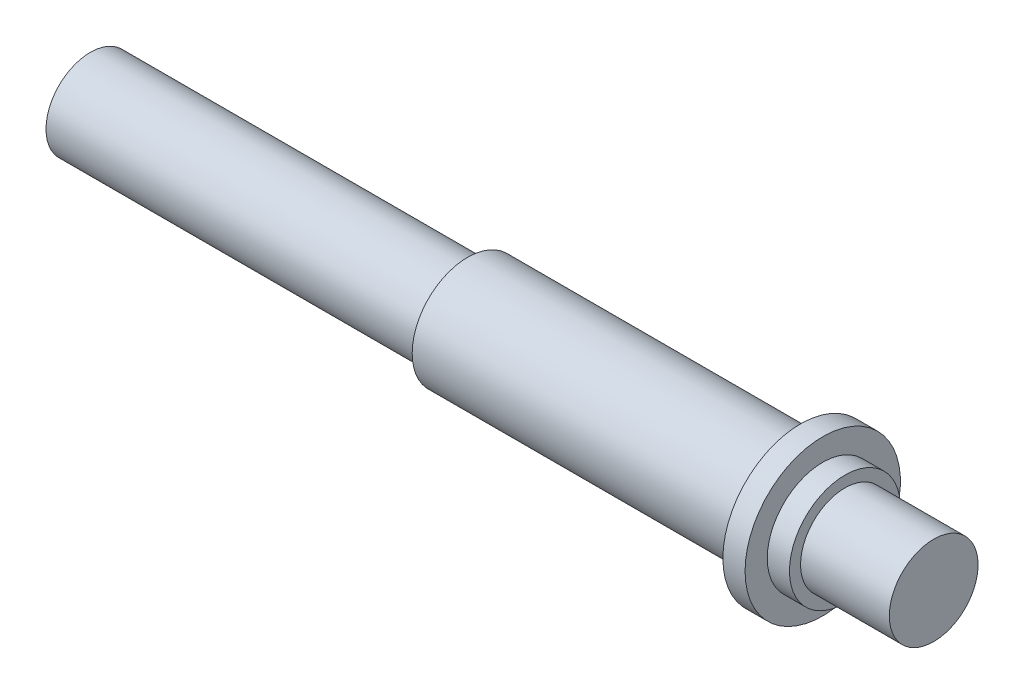
ISO-10303-21;
HEADER;
FILE_DESCRIPTION(('STEP AP214'),'2;1');
FILE_NAME('part.step','',(''),(''),'','','');
FILE_SCHEMA(('AUTOMOTIVE_DESIGN { 1 0 10303 214 1 1 1 1 }'));
ENDSEC;
DATA;
#1=APPLICATION_CONTEXT('core data for automotive mechanical design processes');
#2=APPLICATION_PROTOCOL_DEFINITION('international standard','automotive_design',2000,#1);
#3=PRODUCT_CONTEXT('',#1,'mechanical');
#4=PRODUCT('Part','Part','',(#3));
#5=PRODUCT_RELATED_PRODUCT_CATEGORY('part','',(#4));
#6=PRODUCT_DEFINITION_FORMATION('','',#4);
#7=PRODUCT_DEFINITION_CONTEXT('part definition',#1,'design');
#8=PRODUCT_DEFINITION('design','',#6,#7);
#9=PRODUCT_DEFINITION_SHAPE('','',#8);
#10=(LENGTH_UNIT() NAMED_UNIT(*) SI_UNIT(.MILLI.,.METRE.));
#11=(NAMED_UNIT(*) PLANE_ANGLE_UNIT() SI_UNIT($,.RADIAN.));
#12=(NAMED_UNIT(*) SI_UNIT($,.STERADIAN.) SOLID_ANGLE_UNIT());
#13=UNCERTAINTY_MEASURE_WITH_UNIT(LENGTH_MEASURE(1.E-05),#10,'distance_accuracy_value','');
#14=(GEOMETRIC_REPRESENTATION_CONTEXT(3) GLOBAL_UNCERTAINTY_ASSIGNED_CONTEXT((#13)) GLOBAL_UNIT_ASSIGNED_CONTEXT((#10,
#11,#12)) REPRESENTATION_CONTEXT('',''));
#15=CARTESIAN_POINT('',(0.,0.,0.));
#16=DIRECTION('',(0.,0.,1.));
#17=DIRECTION('',(1.,0.,0.));
#18=AXIS2_PLACEMENT_3D('',#15,#16,#17);
#19=CARTESIAN_POINT('',(-54.8369522712922,0.,0.));
#20=DIRECTION('',(1.,0.,0.));
#21=DIRECTION('',(0.,0.,-1.));
#22=AXIS2_PLACEMENT_3D('',#19,#20,#21);
#23=PLANE('',#22);
#24=CARTESIAN_POINT('',(-54.8369522712922,0.,0.));
#25=DIRECTION('',(-1.,0.,0.));
#26=DIRECTION('',(0.,0.,1.));
#27=AXIS2_PLACEMENT_3D('',#24,#25,#26);
#28=CIRCLE('',#27,2.);
#29=CARTESIAN_POINT('',(-54.8369522712922,0.,2.));
#30=VERTEX_POINT('',#29);
#31=EDGE_CURVE('E10',#30,#30,#28,.T.);
#32=ORIENTED_EDGE('',*,*,#31,.T.);
#33=EDGE_LOOP('',(#32));
#34=FACE_BOUND('',#33,.T.);
#35=ADVANCED_FACE('F30',(#34),#23,.F.);
#36=CARTESIAN_POINT('',(-56.8445338409476,0.,0.));
#37=DIRECTION('',(-1.,0.,0.));
#38=DIRECTION('',(0.,0.,1.));
#39=AXIS2_PLACEMENT_3D('',#36,#37,#38);
#40=CYLINDRICAL_SURFACE('',#39,2.);
#41=ORIENTED_EDGE('',*,*,#31,.F.);
#42=EDGE_LOOP('',(#41));
#43=FACE_BOUND('',#42,.T.);
#44=CARTESIAN_POINT('',(-37.8369522712922,0.,0.));
#45=DIRECTION('',(-1.,0.,0.));
#46=DIRECTION('',(0.,0.,1.));
#47=AXIS2_PLACEMENT_3D('',#44,#45,#46);
#48=CIRCLE('',#47,2.);
#49=CARTESIAN_POINT('',(-37.8369522712922,0.,2.));
#50=VERTEX_POINT('',#49);
#51=EDGE_CURVE('E36',#50,#50,#48,.T.);
#52=ORIENTED_EDGE('',*,*,#51,.T.);
#53=EDGE_LOOP('',(#52));
#54=FACE_BOUND('',#53,.T.);
#55=ADVANCED_FACE('F80',(#43,#54),#40,.T.);
#56=CARTESIAN_POINT('',(-37.8369522712922,2.,0.));
#57=DIRECTION('',(1.,0.,0.));
#58=DIRECTION('',(0.,0.,-1.));
#59=AXIS2_PLACEMENT_3D('',#56,#57,#58);
#60=PLANE('',#59);
#61=ORIENTED_EDGE('',*,*,#51,.F.);
#62=EDGE_LOOP('',(#61));
#63=FACE_BOUND('',#62,.T.);
#64=CARTESIAN_POINT('',(-37.8369522712922,0.,0.));
#65=DIRECTION('',(-1.,0.,0.));
#66=DIRECTION('',(0.,0.,1.));
#67=AXIS2_PLACEMENT_3D('',#64,#65,#66);
#68=CIRCLE('',#67,2.5);
#69=CARTESIAN_POINT('',(-37.8369522712922,0.,2.5));
#70=VERTEX_POINT('',#69);
#71=EDGE_CURVE('E40',#70,#70,#68,.T.);
#72=ORIENTED_EDGE('',*,*,#71,.T.);
#73=EDGE_LOOP('',(#72));
#74=FACE_BOUND('',#73,.T.);
#75=ADVANCED_FACE('F84',(#63,#74),#60,.F.);
#76=CARTESIAN_POINT('',(-56.8445338409476,0.,0.));
#77=DIRECTION('',(-1.,0.,0.));
#78=DIRECTION('',(0.,0.,1.));
#79=AXIS2_PLACEMENT_3D('',#76,#77,#78);
#80=CYLINDRICAL_SURFACE('',#79,2.5);
#81=ORIENTED_EDGE('',*,*,#71,.F.);
#82=EDGE_LOOP('',(#81));
#83=FACE_BOUND('',#82,.T.);
#84=CARTESIAN_POINT('',(-22.8369522712922,0.,0.));
#85=DIRECTION('',(-1.,0.,0.));
#86=DIRECTION('',(0.,0.,1.));
#87=AXIS2_PLACEMENT_3D('',#84,#85,#86);
#88=CIRCLE('',#87,2.5);
#89=CARTESIAN_POINT('',(-22.8369522712922,0.,2.5));
#90=VERTEX_POINT('',#89);
#91=EDGE_CURVE('E44',#90,#90,#88,.T.);
#92=ORIENTED_EDGE('',*,*,#91,.T.);
#93=EDGE_LOOP('',(#92));
#94=FACE_BOUND('',#93,.T.);
#95=ADVANCED_FACE('F89',(#83,#94),#80,.T.);
#96=CARTESIAN_POINT('',(-22.8369522712922,2.5,0.));
#97=DIRECTION('',(1.,0.,0.));
#98=DIRECTION('',(0.,0.,-1.));
#99=AXIS2_PLACEMENT_3D('',#96,#97,#98);
#100=PLANE('',#99);
#101=ORIENTED_EDGE('',*,*,#91,.F.);
#102=EDGE_LOOP('',(#101));
#103=FACE_BOUND('',#102,.T.);
#104=CARTESIAN_POINT('',(-22.8369522712922,0.,0.));
#105=DIRECTION('',(-1.,0.,0.));
#106=DIRECTION('',(0.,0.,1.));
#107=AXIS2_PLACEMENT_3D('',#104,#105,#106);
#108=CIRCLE('',#107,3.5);
#109=CARTESIAN_POINT('',(-22.8369522712922,0.,3.5));
#110=VERTEX_POINT('',#109);
#111=EDGE_CURVE('E49',#110,#110,#108,.T.);
#112=ORIENTED_EDGE('',*,*,#111,.T.);
#113=EDGE_LOOP('',(#112));
#114=FACE_BOUND('',#113,.T.);
#115=ADVANCED_FACE('F95',(#103,#114),#100,.F.);
#116=CARTESIAN_POINT('',(-56.8445338409476,0.,0.));
#117=DIRECTION('',(-1.,0.,0.));
#118=DIRECTION('',(0.,0.,1.));
#119=AXIS2_PLACEMENT_3D('',#116,#117,#118);
#120=CYLINDRICAL_SURFACE('',#119,3.5);
#121=ORIENTED_EDGE('',*,*,#111,.F.);
#122=EDGE_LOOP('',(#121));
#123=FACE_BOUND('',#122,.T.);
#124=CARTESIAN_POINT('',(-21.8369522712922,0.,0.));
#125=DIRECTION('',(-1.,0.,0.));
#126=DIRECTION('',(0.,0.,1.));
#127=AXIS2_PLACEMENT_3D('',#124,#125,#126);
#128=CIRCLE('',#127,3.5);
#129=CARTESIAN_POINT('',(-21.8369522712922,0.,3.5));
#130=VERTEX_POINT('',#129);
#131=EDGE_CURVE('E52',#130,#130,#128,.T.);
#132=ORIENTED_EDGE('',*,*,#131,.T.);
#133=EDGE_LOOP('',(#132));
#134=FACE_BOUND('',#133,.T.);
#135=ADVANCED_FACE('F99',(#123,#134),#120,.T.);
#136=CARTESIAN_POINT('',(-21.8369522712922,3.5,0.));
#137=DIRECTION('',(-1.,0.,0.));
#138=DIRECTION('',(0.,0.,1.));
#139=AXIS2_PLACEMENT_3D('',#136,#137,#138);
#140=PLANE('',#139);
#141=ORIENTED_EDGE('',*,*,#131,.F.);
#142=EDGE_LOOP('',(#141));
#143=FACE_BOUND('',#142,.T.);
#144=CARTESIAN_POINT('',(-21.8369522712922,0.,0.));
#145=DIRECTION('',(-1.,0.,0.));
#146=DIRECTION('',(0.,0.,1.));
#147=AXIS2_PLACEMENT_3D('',#144,#145,#146);
#148=CIRCLE('',#147,2.5);
#149=CARTESIAN_POINT('',(-21.8369522712922,0.,2.5));
#150=VERTEX_POINT('',#149);
#151=EDGE_CURVE('E55',#150,#150,#148,.T.);
#152=ORIENTED_EDGE('',*,*,#151,.T.);
#153=EDGE_LOOP('',(#152));
#154=FACE_BOUND('',#153,.T.);
#155=ADVANCED_FACE('F103',(#143,#154),#140,.F.);
#156=CARTESIAN_POINT('',(-56.8445338409476,0.,0.));
#157=DIRECTION('',(-1.,0.,0.));
#158=DIRECTION('',(0.,0.,1.));
#159=AXIS2_PLACEMENT_3D('',#156,#157,#158);
#160=CYLINDRICAL_SURFACE('',#159,2.5);
#161=ORIENTED_EDGE('',*,*,#151,.F.);
#162=EDGE_LOOP('',(#161));
#163=FACE_BOUND('',#162,.T.);
#164=CARTESIAN_POINT('',(-20.8369522712922,0.,0.));
#165=DIRECTION('',(-1.,0.,0.));
#166=DIRECTION('',(0.,0.,1.));
#167=AXIS2_PLACEMENT_3D('',#164,#165,#166);
#168=CIRCLE('',#167,2.5);
#169=CARTESIAN_POINT('',(-20.8369522712922,0.,2.5));
#170=VERTEX_POINT('',#169);
#171=EDGE_CURVE('E58',#170,#170,#168,.T.);
#172=ORIENTED_EDGE('',*,*,#171,.T.);
#173=EDGE_LOOP('',(#172));
#174=FACE_BOUND('',#173,.T.);
#175=ADVANCED_FACE('F107',(#163,#174),#160,.T.);
#176=CARTESIAN_POINT('',(-20.8369522712922,2.5,0.));
#177=DIRECTION('',(-1.,0.,0.));
#178=DIRECTION('',(0.,0.,1.));
#179=AXIS2_PLACEMENT_3D('',#176,#177,#178);
#180=PLANE('',#179);
#181=ORIENTED_EDGE('',*,*,#171,.F.);
#182=EDGE_LOOP('',(#181));
#183=FACE_BOUND('',#182,.T.);
#184=CARTESIAN_POINT('',(-20.8369522712922,0.,0.));
#185=DIRECTION('',(-1.,0.,0.));
#186=DIRECTION('',(0.,0.,1.));
#187=AXIS2_PLACEMENT_3D('',#184,#185,#186);
#188=CIRCLE('',#187,2.);
#189=CARTESIAN_POINT('',(-20.8369522712922,0.,2.));
#190=VERTEX_POINT('',#189);
#191=EDGE_CURVE('E61',#190,#190,#188,.T.);
#192=ORIENTED_EDGE('',*,*,#191,.T.);
#193=EDGE_LOOP('',(#192));
#194=FACE_BOUND('',#193,.T.);
#195=ADVANCED_FACE('F76',(#183,#194),#180,.F.);
#196=CARTESIAN_POINT('',(-56.8445338409476,0.,0.));
#197=DIRECTION('',(-1.,0.,0.));
#198=DIRECTION('',(0.,0.,1.));
#199=AXIS2_PLACEMENT_3D('',#196,#197,#198);
#200=CYLINDRICAL_SURFACE('',#199,2.);
#201=ORIENTED_EDGE('',*,*,#191,.F.);
#202=EDGE_LOOP('',(#201));
#203=FACE_BOUND('',#202,.T.);
#204=CARTESIAN_POINT('',(-16.8369522712922,0.,0.));
#205=DIRECTION('',(-1.,0.,0.));
#206=DIRECTION('',(0.,0.,1.));
#207=AXIS2_PLACEMENT_3D('',#204,#205,#206);
#208=CIRCLE('',#207,2.);
#209=CARTESIAN_POINT('',(-16.8369522712922,0.,2.));
#210=VERTEX_POINT('',#209);
#211=EDGE_CURVE('E64',#210,#210,#208,.T.);
#212=ORIENTED_EDGE('',*,*,#211,.T.);
#213=EDGE_LOOP('',(#212));
#214=FACE_BOUND('',#213,.T.);
#215=ADVANCED_FACE('F68',(#203,#214),#200,.T.);
#216=CARTESIAN_POINT('',(-16.8369522712922,2.,0.));
#217=DIRECTION('',(-1.,0.,0.));
#218=DIRECTION('',(0.,0.,1.));
#219=AXIS2_PLACEMENT_3D('',#216,#217,#218);
#220=PLANE('',#219);
#221=ORIENTED_EDGE('',*,*,#211,.F.);
#222=EDGE_LOOP('',(#221));
#223=FACE_BOUND('',#222,.T.);
#224=ADVANCED_FACE('F70',(#223),#220,.F.);
#225=CLOSED_SHELL('',(#35,#55,#75,#95,#115,#135,#155,#175,#195,#215,#224));
#226=MANIFOLD_SOLID_BREP('B2',#225);
#227=ADVANCED_BREP_SHAPE_REPRESENTATION('',(#18,#226),#14);
#228=SHAPE_DEFINITION_REPRESENTATION(#9,#227);
ENDSEC;
END-ISO-10303-21;
